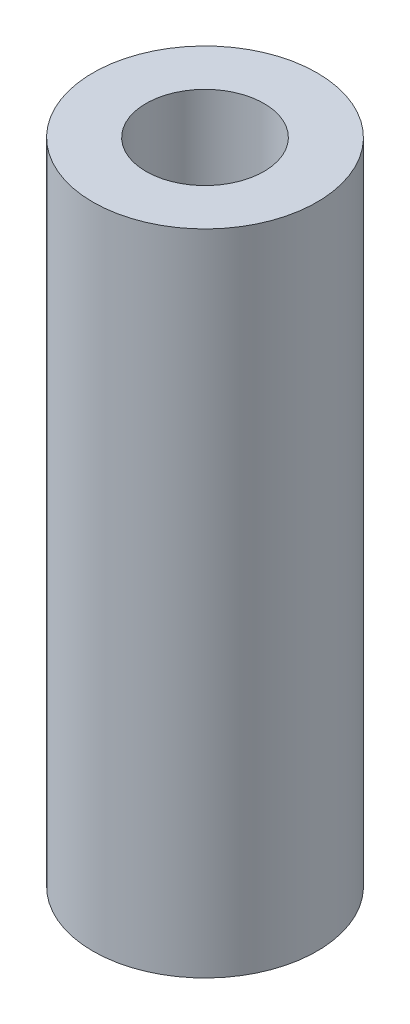
ISO-10303-21;
HEADER;
FILE_DESCRIPTION(('STEP AP214'),'2;1');
FILE_NAME('part.step','',(''),(''),'','','');
FILE_SCHEMA(('AUTOMOTIVE_DESIGN { 1 0 10303 214 1 1 1 1 }'));
ENDSEC;
DATA;
#1=APPLICATION_CONTEXT('core data for automotive mechanical design processes');
#2=APPLICATION_PROTOCOL_DEFINITION('international standard','automotive_design',2000,#1);
#3=PRODUCT_CONTEXT('',#1,'mechanical');
#4=PRODUCT('Part','Part','',(#3));
#5=PRODUCT_RELATED_PRODUCT_CATEGORY('part','',(#4));
#6=PRODUCT_DEFINITION_FORMATION('','',#4);
#7=PRODUCT_DEFINITION_CONTEXT('part definition',#1,'design');
#8=PRODUCT_DEFINITION('design','',#6,#7);
#9=PRODUCT_DEFINITION_SHAPE('','',#8);
#10=(LENGTH_UNIT() NAMED_UNIT(*) SI_UNIT(.MILLI.,.METRE.));
#11=(NAMED_UNIT(*) PLANE_ANGLE_UNIT() SI_UNIT($,.RADIAN.));
#12=(NAMED_UNIT(*) SI_UNIT($,.STERADIAN.) SOLID_ANGLE_UNIT());
#13=UNCERTAINTY_MEASURE_WITH_UNIT(LENGTH_MEASURE(1.E-05),#10,'distance_accuracy_value','');
#14=(GEOMETRIC_REPRESENTATION_CONTEXT(3) GLOBAL_UNCERTAINTY_ASSIGNED_CONTEXT((#13)) GLOBAL_UNIT_ASSIGNED_CONTEXT((#10,
#11,#12)) REPRESENTATION_CONTEXT('',''));
#15=CARTESIAN_POINT('',(0.,0.,0.));
#16=DIRECTION('',(0.,0.,1.));
#17=DIRECTION('',(1.,0.,0.));
#18=AXIS2_PLACEMENT_3D('',#15,#16,#17);
#19=CARTESIAN_POINT('',(0.,55.,0.));
#20=DIRECTION('',(0.,1.,0.));
#21=DIRECTION('',(0.,0.,1.));
#22=AXIS2_PLACEMENT_3D('',#19,#20,#21);
#23=PLANE('',#22);
#24=CARTESIAN_POINT('',(0.,55.,0.));
#25=DIRECTION('',(0.,1.,0.));
#26=DIRECTION('',(0.,0.,1.));
#27=AXIS2_PLACEMENT_3D('',#24,#25,#26);
#28=CIRCLE('',#27,9.5);
#29=CARTESIAN_POINT('',(0.,55.,9.5));
#30=VERTEX_POINT('',#29);
#31=EDGE_CURVE('E10',#30,#30,#28,.T.);
#32=ORIENTED_EDGE('',*,*,#31,.T.);
#33=EDGE_LOOP('',(#32));
#34=FACE_BOUND('',#33,.T.);
#35=CARTESIAN_POINT('',(0.,55.,0.));
#36=DIRECTION('',(0.,1.,0.));
#37=DIRECTION('',(0.,0.,1.));
#38=AXIS2_PLACEMENT_3D('',#35,#36,#37);
#39=CIRCLE('',#38,5.);
#40=CARTESIAN_POINT('',(0.,55.,5.));
#41=VERTEX_POINT('',#40);
#42=EDGE_CURVE('E44',#41,#41,#39,.T.);
#43=ORIENTED_EDGE('',*,*,#42,.F.);
#44=EDGE_LOOP('',(#43));
#45=FACE_BOUND('',#44,.T.);
#46=ADVANCED_FACE('F33',(#34,#45),#23,.T.);
#47=CARTESIAN_POINT('',(0.,0.,0.));
#48=DIRECTION('',(0.,1.,0.));
#49=DIRECTION('',(0.,0.,1.));
#50=AXIS2_PLACEMENT_3D('',#47,#48,#49);
#51=PLANE('',#50);
#52=CARTESIAN_POINT('',(0.,0.,0.));
#53=DIRECTION('',(0.,1.,0.));
#54=DIRECTION('',(0.,0.,1.));
#55=AXIS2_PLACEMENT_3D('',#52,#53,#54);
#56=CIRCLE('',#55,9.5);
#57=CARTESIAN_POINT('',(0.,0.,9.5));
#58=VERTEX_POINT('',#57);
#59=EDGE_CURVE('E37',#58,#58,#56,.T.);
#60=ORIENTED_EDGE('',*,*,#59,.F.);
#61=EDGE_LOOP('',(#60));
#62=FACE_BOUND('',#61,.T.);
#63=CARTESIAN_POINT('',(0.,0.,0.));
#64=DIRECTION('',(0.,1.,0.));
#65=DIRECTION('',(0.,0.,1.));
#66=AXIS2_PLACEMENT_3D('',#63,#64,#65);
#67=CIRCLE('',#66,5.);
#68=CARTESIAN_POINT('',(0.,0.,5.));
#69=VERTEX_POINT('',#68);
#70=EDGE_CURVE('E46',#69,#69,#67,.T.);
#71=ORIENTED_EDGE('',*,*,#70,.T.);
#72=EDGE_LOOP('',(#71));
#73=FACE_BOUND('',#72,.T.);
#74=ADVANCED_FACE('F56',(#62,#73),#51,.F.);
#75=CARTESIAN_POINT('',(0.,55.,0.));
#76=DIRECTION('',(0.,-1.,0.));
#77=DIRECTION('',(0.,0.,-1.));
#78=AXIS2_PLACEMENT_3D('',#75,#76,#77);
#79=CYLINDRICAL_SURFACE('',#78,9.5);
#80=ORIENTED_EDGE('',*,*,#31,.F.);
#81=EDGE_LOOP('',(#80));
#82=FACE_BOUND('',#81,.T.);
#83=ORIENTED_EDGE('',*,*,#59,.T.);
#84=EDGE_LOOP('',(#83));
#85=FACE_BOUND('',#84,.T.);
#86=ADVANCED_FACE('F35',(#82,#85),#79,.T.);
#87=CARTESIAN_POINT('',(0.,55.,0.));
#88=DIRECTION('',(0.,-1.,0.));
#89=DIRECTION('',(0.,0.,-1.));
#90=AXIS2_PLACEMENT_3D('',#87,#88,#89);
#91=CYLINDRICAL_SURFACE('',#90,5.);
#92=ORIENTED_EDGE('',*,*,#42,.T.);
#93=EDGE_LOOP('',(#92));
#94=FACE_BOUND('',#93,.T.);
#95=ORIENTED_EDGE('',*,*,#70,.F.);
#96=EDGE_LOOP('',(#95));
#97=FACE_BOUND('',#96,.T.);
#98=ADVANCED_FACE('F52',(#94,#97),#91,.F.);
#99=CLOSED_SHELL('',(#46,#74,#86,#98));
#100=MANIFOLD_SOLID_BREP('B2',#99);
#101=ADVANCED_BREP_SHAPE_REPRESENTATION('',(#18,#100),#14);
#102=SHAPE_DEFINITION_REPRESENTATION(#9,#101);
ENDSEC;
END-ISO-10303-21;
